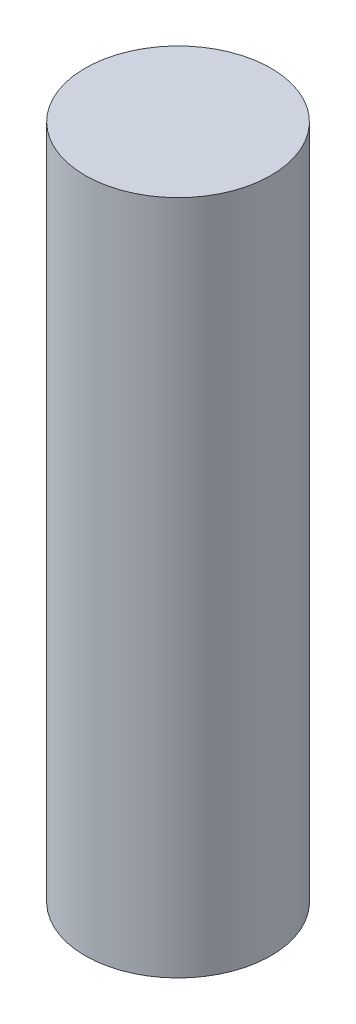
ISO-10303-21;
HEADER;
FILE_DESCRIPTION(('STEP AP214'),'2;1');
FILE_NAME('part.step','',(''),(''),'','','');
FILE_SCHEMA(('AUTOMOTIVE_DESIGN { 1 0 10303 214 1 1 1 1 }'));
ENDSEC;
DATA;
#1=APPLICATION_CONTEXT('core data for automotive mechanical design processes');
#2=APPLICATION_PROTOCOL_DEFINITION('international standard','automotive_design',2000,#1);
#3=PRODUCT_CONTEXT('',#1,'mechanical');
#4=PRODUCT('Part','Part','',(#3));
#5=PRODUCT_RELATED_PRODUCT_CATEGORY('part','',(#4));
#6=PRODUCT_DEFINITION_FORMATION('','',#4);
#7=PRODUCT_DEFINITION_CONTEXT('part definition',#1,'design');
#8=PRODUCT_DEFINITION('design','',#6,#7);
#9=PRODUCT_DEFINITION_SHAPE('','',#8);
#10=(LENGTH_UNIT() NAMED_UNIT(*) SI_UNIT(.MILLI.,.METRE.));
#11=(NAMED_UNIT(*) PLANE_ANGLE_UNIT() SI_UNIT($,.RADIAN.));
#12=(NAMED_UNIT(*) SI_UNIT($,.STERADIAN.) SOLID_ANGLE_UNIT());
#13=UNCERTAINTY_MEASURE_WITH_UNIT(LENGTH_MEASURE(1.E-05),#10,'distance_accuracy_value','');
#14=(GEOMETRIC_REPRESENTATION_CONTEXT(3) GLOBAL_UNCERTAINTY_ASSIGNED_CONTEXT((#13)) GLOBAL_UNIT_ASSIGNED_CONTEXT((#10,
#11,#12)) REPRESENTATION_CONTEXT('',''));
#15=CARTESIAN_POINT('',(0.,0.,0.));
#16=DIRECTION('',(0.,0.,1.));
#17=DIRECTION('',(1.,0.,0.));
#18=AXIS2_PLACEMENT_3D('',#15,#16,#17);
#19=CARTESIAN_POINT('',(0.,90.,0.));
#20=DIRECTION('',(0.,-1.,0.));
#21=DIRECTION('',(0.,0.,-1.));
#22=AXIS2_PLACEMENT_3D('',#19,#20,#21);
#23=CYLINDRICAL_SURFACE('',#22,12.375);
#24=CARTESIAN_POINT('',(0.,90.,0.));
#25=DIRECTION('',(0.,1.,0.));
#26=DIRECTION('',(0.,0.,1.));
#27=AXIS2_PLACEMENT_3D('',#24,#25,#26);
#28=CIRCLE('',#27,12.375);
#29=CARTESIAN_POINT('',(0.,90.,12.375));
#30=VERTEX_POINT('',#29);
#31=EDGE_CURVE('E10',#30,#30,#28,.T.);
#32=ORIENTED_EDGE('',*,*,#31,.F.);
#33=EDGE_LOOP('',(#32));
#34=FACE_BOUND('',#33,.T.);
#35=CARTESIAN_POINT('',(0.,0.,0.));
#36=DIRECTION('',(0.,1.,0.));
#37=DIRECTION('',(0.,0.,1.));
#38=AXIS2_PLACEMENT_3D('',#35,#36,#37);
#39=CIRCLE('',#38,12.375);
#40=CARTESIAN_POINT('',(0.,0.,12.375));
#41=VERTEX_POINT('',#40);
#42=EDGE_CURVE('E34',#41,#41,#39,.T.);
#43=ORIENTED_EDGE('',*,*,#42,.T.);
#44=EDGE_LOOP('',(#43));
#45=FACE_BOUND('',#44,.T.);
#46=ADVANCED_FACE('F31',(#34,#45),#23,.T.);
#47=CARTESIAN_POINT('',(0.,90.,0.));
#48=DIRECTION('',(0.,1.,0.));
#49=DIRECTION('',(0.,0.,1.));
#50=AXIS2_PLACEMENT_3D('',#47,#48,#49);
#51=PLANE('',#50);
#52=ORIENTED_EDGE('',*,*,#31,.T.);
#53=EDGE_LOOP('',(#52));
#54=FACE_BOUND('',#53,.T.);
#55=ADVANCED_FACE('F46',(#54),#51,.T.);
#56=CARTESIAN_POINT('',(0.,0.,0.));
#57=DIRECTION('',(0.,1.,0.));
#58=DIRECTION('',(0.,0.,1.));
#59=AXIS2_PLACEMENT_3D('',#56,#57,#58);
#60=PLANE('',#59);
#61=ORIENTED_EDGE('',*,*,#42,.F.);
#62=EDGE_LOOP('',(#61));
#63=FACE_BOUND('',#62,.T.);
#64=ADVANCED_FACE('F44',(#63),#60,.F.);
#65=CLOSED_SHELL('',(#46,#55,#64));
#66=MANIFOLD_SOLID_BREP('B2',#65);
#67=ADVANCED_BREP_SHAPE_REPRESENTATION('',(#18,#66),#14);
#68=SHAPE_DEFINITION_REPRESENTATION(#9,#67);
ENDSEC;
END-ISO-10303-21;
